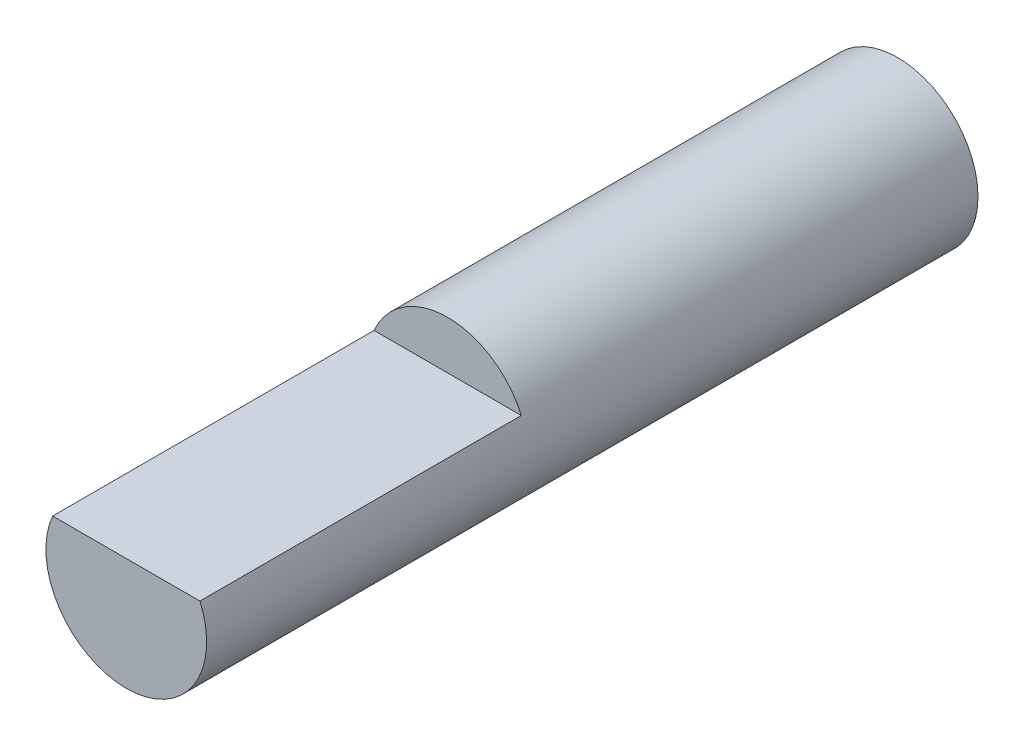
ISO-10303-21;
HEADER;
FILE_DESCRIPTION(('STEP AP214'),'2;1');
FILE_NAME('part.step','',(''),(''),'','','');
FILE_SCHEMA(('AUTOMOTIVE_DESIGN { 1 0 10303 214 1 1 1 1 }'));
ENDSEC;
DATA;
#1=APPLICATION_CONTEXT('core data for automotive mechanical design processes');
#2=APPLICATION_PROTOCOL_DEFINITION('international standard','automotive_design',2000,#1);
#3=PRODUCT_CONTEXT('',#1,'mechanical');
#4=PRODUCT('Part','Part','',(#3));
#5=PRODUCT_RELATED_PRODUCT_CATEGORY('part','',(#4));
#6=PRODUCT_DEFINITION_FORMATION('','',#4);
#7=PRODUCT_DEFINITION_CONTEXT('part definition',#1,'design');
#8=PRODUCT_DEFINITION('design','',#6,#7);
#9=PRODUCT_DEFINITION_SHAPE('','',#8);
#10=(LENGTH_UNIT() NAMED_UNIT(*) SI_UNIT(.MILLI.,.METRE.));
#11=(NAMED_UNIT(*) PLANE_ANGLE_UNIT() SI_UNIT($,.RADIAN.));
#12=(NAMED_UNIT(*) SI_UNIT($,.STERADIAN.) SOLID_ANGLE_UNIT());
#13=UNCERTAINTY_MEASURE_WITH_UNIT(LENGTH_MEASURE(1.E-05),#10,'distance_accuracy_value','');
#14=(GEOMETRIC_REPRESENTATION_CONTEXT(3) GLOBAL_UNCERTAINTY_ASSIGNED_CONTEXT((#13)) GLOBAL_UNIT_ASSIGNED_CONTEXT((#10,
#11,#12)) REPRESENTATION_CONTEXT('',''));
#15=CARTESIAN_POINT('',(0.,0.,0.));
#16=DIRECTION('',(0.,0.,1.));
#17=DIRECTION('',(1.,0.,0.));
#18=AXIS2_PLACEMENT_3D('',#15,#16,#17);
#19=CARTESIAN_POINT('',(0.,0.,24.));
#20=DIRECTION('',(0.,0.,-1.));
#21=DIRECTION('',(-1.,0.,0.));
#22=AXIS2_PLACEMENT_3D('',#19,#20,#21);
#23=CYLINDRICAL_SURFACE('',#22,2.5);
#24=CARTESIAN_POINT('',(0.,0.,24.));
#25=DIRECTION('',(0.,0.,1.));
#26=DIRECTION('',(1.,0.,0.));
#27=AXIS2_PLACEMENT_3D('',#24,#25,#26);
#28=CIRCLE('',#27,2.5);
#29=CARTESIAN_POINT('',(-2.29128784747792,1.,24.));
#30=VERTEX_POINT('',#29);
#31=CARTESIAN_POINT('',(2.29128784747792,1.,24.));
#32=VERTEX_POINT('',#31);
#33=EDGE_CURVE('E13',#30,#32,#28,.T.);
#34=ORIENTED_EDGE('',*,*,#33,.F.);
#35=DIRECTION('',(0.,0.,1.));
#36=VECTOR('',#35,1.);
#37=CARTESIAN_POINT('',(-2.29128784747792,1.,14.));
#38=LINE('',#37,#36);
#39=CARTESIAN_POINT('',(-2.29128784747792,1.,14.));
#40=VERTEX_POINT('',#39);
#41=EDGE_CURVE('E58',#40,#30,#38,.T.);
#42=ORIENTED_EDGE('',*,*,#41,.F.);
#43=CARTESIAN_POINT('',(0.,0.,14.));
#44=DIRECTION('',(0.,0.,1.));
#45=DIRECTION('',(1.,0.,0.));
#46=AXIS2_PLACEMENT_3D('',#43,#44,#45);
#47=CIRCLE('',#46,2.5);
#48=CARTESIAN_POINT('',(2.29128784747792,1.,14.));
#49=VERTEX_POINT('',#48);
#50=EDGE_CURVE('E73',#49,#40,#47,.T.);
#51=ORIENTED_EDGE('',*,*,#50,.F.);
#52=DIRECTION('',(0.,0.,1.));
#53=VECTOR('',#52,1.);
#54=CARTESIAN_POINT('',(2.29128784747792,1.,14.));
#55=LINE('',#54,#53);
#56=EDGE_CURVE('E64',#49,#32,#55,.T.);
#57=ORIENTED_EDGE('',*,*,#56,.T.);
#58=EDGE_LOOP('',(#34,#42,#51,#57));
#59=FACE_BOUND('',#58,.T.);
#60=CARTESIAN_POINT('',(0.,0.,0.));
#61=DIRECTION('',(0.,0.,1.));
#62=DIRECTION('',(1.,0.,0.));
#63=AXIS2_PLACEMENT_3D('',#60,#61,#62);
#64=CIRCLE('',#63,2.5);
#65=CARTESIAN_POINT('',(2.5,0.,0.));
#66=VERTEX_POINT('',#65);
#67=EDGE_CURVE('E47',#66,#66,#64,.T.);
#68=ORIENTED_EDGE('',*,*,#67,.T.);
#69=EDGE_LOOP('',(#68));
#70=FACE_BOUND('',#69,.T.);
#71=ADVANCED_FACE('F44',(#59,#70),#23,.T.);
#72=CARTESIAN_POINT('',(0.,0.,24.));
#73=DIRECTION('',(0.,0.,1.));
#74=DIRECTION('',(1.,0.,0.));
#75=AXIS2_PLACEMENT_3D('',#72,#73,#74);
#76=PLANE('',#75);
#77=DIRECTION('',(1.,0.,0.));
#78=VECTOR('',#77,1.);
#79=CARTESIAN_POINT('',(-2.29128784747792,1.,24.));
#80=LINE('',#79,#78);
#81=EDGE_CURVE('E69',#30,#32,#80,.T.);
#82=ORIENTED_EDGE('',*,*,#81,.F.);
#83=ORIENTED_EDGE('',*,*,#33,.T.);
#84=EDGE_LOOP('',(#82,#83));
#85=FACE_BOUND('',#84,.T.);
#86=ADVANCED_FACE('F79',(#85),#76,.T.);
#87=CARTESIAN_POINT('',(0.,0.,0.));
#88=DIRECTION('',(0.,0.,1.));
#89=DIRECTION('',(1.,0.,0.));
#90=AXIS2_PLACEMENT_3D('',#87,#88,#89);
#91=PLANE('',#90);
#92=ORIENTED_EDGE('',*,*,#67,.F.);
#93=EDGE_LOOP('',(#92));
#94=FACE_BOUND('',#93,.T.);
#95=ADVANCED_FACE('F81',(#94),#91,.F.);
#96=CARTESIAN_POINT('',(-2.29128784747792,1.,14.));
#97=DIRECTION('',(0.,-1.,0.));
#98=DIRECTION('',(0.,0.,-1.));
#99=AXIS2_PLACEMENT_3D('',#96,#97,#98);
#100=PLANE('',#99);
#101=ORIENTED_EDGE('',*,*,#81,.T.);
#102=ORIENTED_EDGE('',*,*,#56,.F.);
#103=DIRECTION('',(1.,0.,0.));
#104=VECTOR('',#103,1.);
#105=CARTESIAN_POINT('',(-2.29128784747792,1.,14.));
#106=LINE('',#105,#104);
#107=EDGE_CURVE('E96',#40,#49,#106,.T.);
#108=ORIENTED_EDGE('',*,*,#107,.F.);
#109=ORIENTED_EDGE('',*,*,#41,.T.);
#110=EDGE_LOOP('',(#101,#102,#108,#109));
#111=FACE_BOUND('',#110,.T.);
#112=ADVANCED_FACE('F70',(#111),#100,.F.);
#113=CARTESIAN_POINT('',(0.,0.,14.));
#114=DIRECTION('',(0.,0.,1.));
#115=DIRECTION('',(1.,0.,0.));
#116=AXIS2_PLACEMENT_3D('',#113,#114,#115);
#117=PLANE('',#116);
#118=ORIENTED_EDGE('',*,*,#50,.T.);
#119=ORIENTED_EDGE('',*,*,#107,.T.);
#120=EDGE_LOOP('',(#118,#119));
#121=FACE_BOUND('',#120,.T.);
#122=ADVANCED_FACE('F91',(#121),#117,.T.);
#123=CLOSED_SHELL('',(#71,#86,#95,#112,#122));
#124=MANIFOLD_SOLID_BREP('B2',#123);
#125=ADVANCED_BREP_SHAPE_REPRESENTATION('',(#18,#124),#14);
#126=SHAPE_DEFINITION_REPRESENTATION(#9,#125);
ENDSEC;
END-ISO-10303-21;
